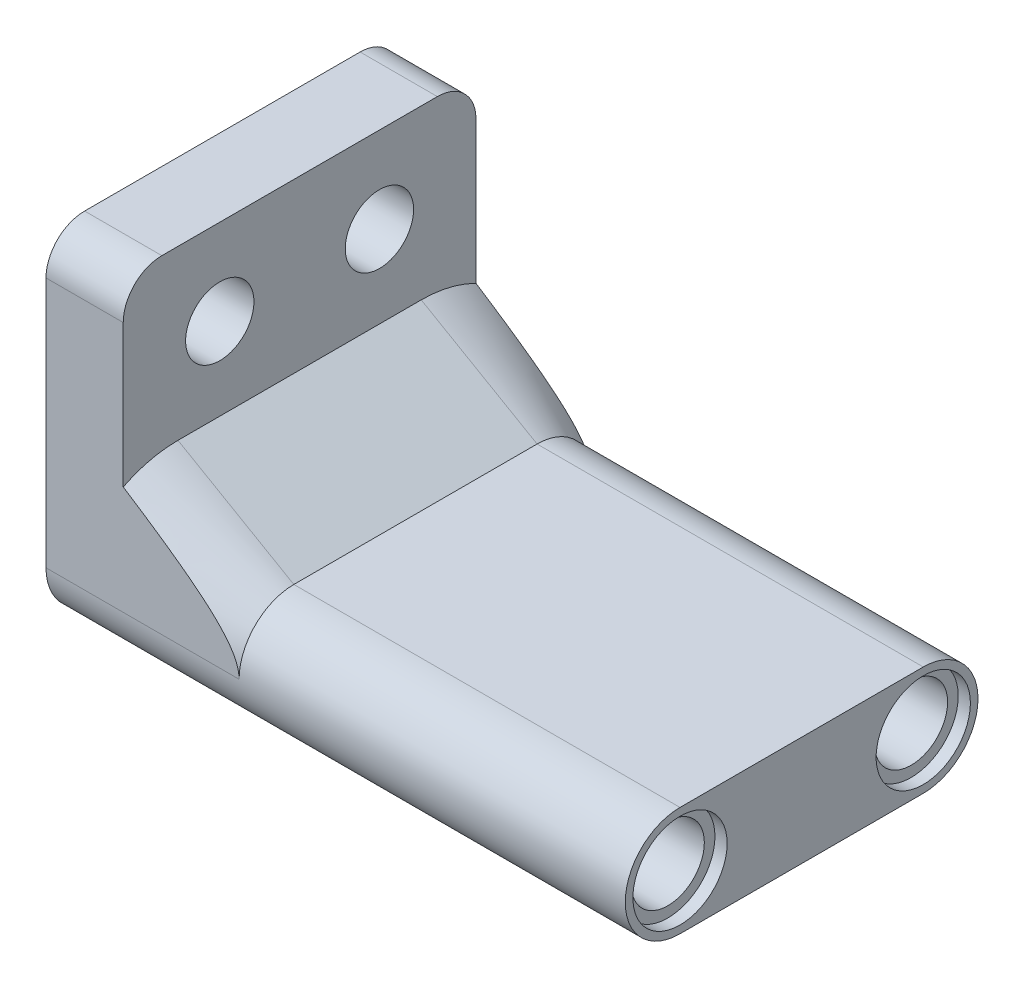
ISO-10303-21;
HEADER;
FILE_DESCRIPTION(('STEP AP214'),'2;1');
FILE_NAME('part.step','',(''),(''),'','','');
FILE_SCHEMA(('AUTOMOTIVE_DESIGN { 1 0 10303 214 1 1 1 1 }'));
ENDSEC;
DATA;
#1=APPLICATION_CONTEXT('core data for automotive mechanical design processes');
#2=APPLICATION_PROTOCOL_DEFINITION('international standard','automotive_design',2000,#1);
#3=PRODUCT_CONTEXT('',#1,'mechanical');
#4=PRODUCT('Part','Part','',(#3));
#5=PRODUCT_RELATED_PRODUCT_CATEGORY('part','',(#4));
#6=PRODUCT_DEFINITION_FORMATION('','',#4);
#7=PRODUCT_DEFINITION_CONTEXT('part definition',#1,'design');
#8=PRODUCT_DEFINITION('design','',#6,#7);
#9=PRODUCT_DEFINITION_SHAPE('','',#8);
#10=(LENGTH_UNIT() NAMED_UNIT(*) SI_UNIT(.MILLI.,.METRE.));
#11=(NAMED_UNIT(*) PLANE_ANGLE_UNIT() SI_UNIT($,.RADIAN.));
#12=(NAMED_UNIT(*) SI_UNIT($,.STERADIAN.) SOLID_ANGLE_UNIT());
#13=UNCERTAINTY_MEASURE_WITH_UNIT(LENGTH_MEASURE(1.E-05),#10,'distance_accuracy_value','');
#14=(GEOMETRIC_REPRESENTATION_CONTEXT(3) GLOBAL_UNCERTAINTY_ASSIGNED_CONTEXT((#13)) GLOBAL_UNIT_ASSIGNED_CONTEXT((#10,
#11,#12)) REPRESENTATION_CONTEXT('',''));
#15=CARTESIAN_POINT('',(0.,0.,0.));
#16=DIRECTION('',(0.,0.,1.));
#17=DIRECTION('',(1.,0.,0.));
#18=AXIS2_PLACEMENT_3D('',#15,#16,#17);
#19=CARTESIAN_POINT('',(38.1,3.59999999999999,16.));
#20=DIRECTION('',(-1.,0.,0.));
#21=DIRECTION('',(0.,0.,1.));
#22=AXIS2_PLACEMENT_3D('',#19,#20,#21);
#23=CYLINDRICAL_SURFACE('',#22,3.6);
#24=DIRECTION('',(-1.,0.,0.));
#25=VECTOR('',#24,1.);
#26=CARTESIAN_POINT('',(38.1,7.2,16.));
#27=LINE('',#26,#25);
#28=CARTESIAN_POINT('',(38.1,7.2,16.));
#29=VERTEX_POINT('',#28);
#30=CARTESIAN_POINT('',(12.7,7.2,16.));
#31=VERTEX_POINT('',#30);
#32=EDGE_CURVE('E369',#29,#31,#27,.T.);
#33=ORIENTED_EDGE('',*,*,#32,.T.);
#34=CARTESIAN_POINT('',(12.7,3.59999999999999,16.));
#35=DIRECTION('',(-1.,0.,0.));
#36=DIRECTION('',(0.,0.,1.));
#37=AXIS2_PLACEMENT_3D('',#34,#35,#36);
#38=CIRCLE('',#37,3.6);
#39=CARTESIAN_POINT('',(12.7,3.60000008799999,19.6));
#40=VERTEX_POINT('',#39);
#41=EDGE_CURVE('E209',#31,#40,#38,.F.);
#42=ORIENTED_EDGE('',*,*,#41,.T.);
#43=DIRECTION('',(1.,0.,0.));
#44=VECTOR('',#43,1.);
#45=CARTESIAN_POINT('',(0.,3.60000008799999,19.6));
#46=LINE('',#45,#44);
#47=CARTESIAN_POINT('',(0.,3.60000008799999,19.6));
#48=VERTEX_POINT('',#47);
#49=EDGE_CURVE('E297',#48,#40,#46,.T.);
#50=ORIENTED_EDGE('',*,*,#49,.F.);
#51=CARTESIAN_POINT('',(0.,3.59999999999999,16.));
#52=DIRECTION('',(1.,0.,0.));
#53=DIRECTION('',(0.,0.,-1.));
#54=AXIS2_PLACEMENT_3D('',#51,#52,#53);
#55=CIRCLE('',#54,3.6);
#56=CARTESIAN_POINT('',(0.,0.,16.));
#57=VERTEX_POINT('',#56);
#58=EDGE_CURVE('E164',#48,#57,#55,.T.);
#59=ORIENTED_EDGE('',*,*,#58,.T.);
#60=DIRECTION('',(-1.,0.,0.));
#61=VECTOR('',#60,1.);
#62=CARTESIAN_POINT('',(38.1,0.,16.));
#63=LINE('',#62,#61);
#64=CARTESIAN_POINT('',(38.1,0.,16.));
#65=VERTEX_POINT('',#64);
#66=EDGE_CURVE('E143',#65,#57,#63,.T.);
#67=ORIENTED_EDGE('',*,*,#66,.F.);
#68=CARTESIAN_POINT('',(38.1,3.59999999999999,16.));
#69=DIRECTION('',(1.,0.,0.));
#70=DIRECTION('',(0.,0.,-1.));
#71=AXIS2_PLACEMENT_3D('',#68,#69,#70);
#72=CIRCLE('',#71,3.6);
#73=EDGE_CURVE('E150',#29,#65,#72,.T.);
#74=ORIENTED_EDGE('',*,*,#73,.F.);
#75=EDGE_LOOP('',(#33,#42,#50,#59,#67,#74));
#76=FACE_BOUND('',#75,.T.);
#77=ADVANCED_FACE('F45',(#76),#23,.T.);
#78=CARTESIAN_POINT('',(38.1,3.6,0.));
#79=DIRECTION('',(-1.,0.,0.));
#80=DIRECTION('',(0.,0.,1.));
#81=AXIS2_PLACEMENT_3D('',#78,#79,#80);
#82=CYLINDRICAL_SURFACE('',#81,3.6);
#83=DIRECTION('',(-1.,0.,0.));
#84=VECTOR('',#83,1.);
#85=CARTESIAN_POINT('',(0.,3.600000088,-3.6));
#86=LINE('',#85,#84);
#87=CARTESIAN_POINT('',(12.7,3.600000088,-3.6));
#88=VERTEX_POINT('',#87);
#89=CARTESIAN_POINT('',(0.,3.600000088,-3.6));
#90=VERTEX_POINT('',#89);
#91=EDGE_CURVE('E65',#88,#90,#86,.T.);
#92=ORIENTED_EDGE('',*,*,#91,.F.);
#93=CARTESIAN_POINT('',(12.7,3.6,0.));
#94=DIRECTION('',(-1.,0.,0.));
#95=DIRECTION('',(0.,0.,1.));
#96=AXIS2_PLACEMENT_3D('',#93,#94,#95);
#97=CIRCLE('',#96,3.6);
#98=CARTESIAN_POINT('',(12.7,7.2,0.));
#99=VERTEX_POINT('',#98);
#100=EDGE_CURVE('E69',#88,#99,#97,.F.);
#101=ORIENTED_EDGE('',*,*,#100,.T.);
#102=DIRECTION('',(-1.,0.,0.));
#103=VECTOR('',#102,1.);
#104=CARTESIAN_POINT('',(38.1,7.2,0.));
#105=LINE('',#104,#103);
#106=CARTESIAN_POINT('',(38.1,7.2,0.));
#107=VERTEX_POINT('',#106);
#108=EDGE_CURVE('E174',#107,#99,#105,.T.);
#109=ORIENTED_EDGE('',*,*,#108,.F.);
#110=CARTESIAN_POINT('',(38.1,3.6,0.));
#111=DIRECTION('',(1.,0.,0.));
#112=DIRECTION('',(0.,0.,-1.));
#113=AXIS2_PLACEMENT_3D('',#110,#111,#112);
#114=CIRCLE('',#113,3.6);
#115=CARTESIAN_POINT('',(38.1,0.,0.));
#116=VERTEX_POINT('',#115);
#117=EDGE_CURVE('E149',#116,#107,#114,.T.);
#118=ORIENTED_EDGE('',*,*,#117,.F.);
#119=DIRECTION('',(-1.,0.,0.));
#120=VECTOR('',#119,1.);
#121=CARTESIAN_POINT('',(38.1,0.,0.));
#122=LINE('',#121,#120);
#123=CARTESIAN_POINT('',(0.,0.,0.));
#124=VERTEX_POINT('',#123);
#125=EDGE_CURVE('E145',#116,#124,#122,.T.);
#126=ORIENTED_EDGE('',*,*,#125,.T.);
#127=CARTESIAN_POINT('',(0.,3.6,0.));
#128=DIRECTION('',(1.,0.,0.));
#129=DIRECTION('',(0.,0.,-1.));
#130=AXIS2_PLACEMENT_3D('',#127,#128,#129);
#131=CIRCLE('',#130,3.6);
#132=EDGE_CURVE('E160',#124,#90,#131,.T.);
#133=ORIENTED_EDGE('',*,*,#132,.T.);
#134=EDGE_LOOP('',(#92,#101,#109,#118,#126,#133));
#135=FACE_BOUND('',#134,.T.);
#136=ADVANCED_FACE('F257',(#135),#82,.T.);
#137=CARTESIAN_POINT('',(38.1,7.2,0.));
#138=DIRECTION('',(0.,-1.,0.));
#139=DIRECTION('',(0.,0.,-1.));
#140=AXIS2_PLACEMENT_3D('',#137,#138,#139);
#141=PLANE('',#140);
#142=ORIENTED_EDGE('',*,*,#108,.T.);
#143=DIRECTION('',(0.,0.,1.));
#144=VECTOR('',#143,1.);
#145=CARTESIAN_POINT('',(12.7,7.2,16.));
#146=LINE('',#145,#144);
#147=EDGE_CURVE('E215',#99,#31,#146,.T.);
#148=ORIENTED_EDGE('',*,*,#147,.T.);
#149=ORIENTED_EDGE('',*,*,#32,.F.);
#150=DIRECTION('',(0.,0.,1.));
#151=VECTOR('',#150,1.);
#152=CARTESIAN_POINT('',(38.1,7.2,0.));
#153=LINE('',#152,#151);
#154=EDGE_CURVE('E155',#107,#29,#153,.T.);
#155=ORIENTED_EDGE('',*,*,#154,.F.);
#156=EDGE_LOOP('',(#142,#148,#149,#155));
#157=FACE_BOUND('',#156,.T.);
#158=ADVANCED_FACE('F262',(#157),#141,.F.);
#159=CARTESIAN_POINT('',(38.1,0.,0.));
#160=DIRECTION('',(0.,1.,0.));
#161=DIRECTION('',(0.,0.,1.));
#162=AXIS2_PLACEMENT_3D('',#159,#160,#161);
#163=PLANE('',#162);
#164=DIRECTION('',(0.,0.,-1.));
#165=VECTOR('',#164,1.);
#166=CARTESIAN_POINT('',(0.,0.,0.));
#167=LINE('',#166,#165);
#168=EDGE_CURVE('E372',#57,#124,#167,.T.);
#169=ORIENTED_EDGE('',*,*,#168,.T.);
#170=ORIENTED_EDGE('',*,*,#125,.F.);
#171=DIRECTION('',(0.,0.,-1.));
#172=VECTOR('',#171,1.);
#173=CARTESIAN_POINT('',(38.1,0.,0.));
#174=LINE('',#173,#172);
#175=EDGE_CURVE('E139',#65,#116,#174,.T.);
#176=ORIENTED_EDGE('',*,*,#175,.F.);
#177=ORIENTED_EDGE('',*,*,#66,.T.);
#178=EDGE_LOOP('',(#169,#170,#176,#177));
#179=FACE_BOUND('',#178,.T.);
#180=ADVANCED_FACE('F141',(#179),#163,.F.);
#181=CARTESIAN_POINT('',(38.1,3.59999999999999,16.));
#182=DIRECTION('',(1.,0.,0.));
#183=DIRECTION('',(0.,0.,-1.));
#184=AXIS2_PLACEMENT_3D('',#181,#182,#183);
#185=PLANE('',#184);
#186=CARTESIAN_POINT('',(38.1,3.6,0.));
#187=DIRECTION('',(1.,0.,0.));
#188=DIRECTION('',(0.,0.,-1.));
#189=AXIS2_PLACEMENT_3D('',#186,#187,#188);
#190=CIRCLE('',#189,3.1);
#191=CARTESIAN_POINT('',(38.1,3.6,-3.1));
#192=VERTEX_POINT('',#191);
#193=EDGE_CURVE('E339',#192,#192,#190,.T.);
#194=ORIENTED_EDGE('',*,*,#193,.F.);
#195=EDGE_LOOP('',(#194));
#196=FACE_BOUND('',#195,.T.);
#197=CARTESIAN_POINT('',(38.1,3.6,16.000000088));
#198=DIRECTION('',(1.,0.,0.));
#199=DIRECTION('',(0.,0.,-1.));
#200=AXIS2_PLACEMENT_3D('',#197,#198,#199);
#201=CIRCLE('',#200,3.1);
#202=CARTESIAN_POINT('',(38.1,3.6,12.900000088));
#203=VERTEX_POINT('',#202);
#204=EDGE_CURVE('E351',#203,#203,#201,.T.);
#205=ORIENTED_EDGE('',*,*,#204,.F.);
#206=EDGE_LOOP('',(#205));
#207=FACE_BOUND('',#206,.T.);
#208=ORIENTED_EDGE('',*,*,#73,.T.);
#209=ORIENTED_EDGE('',*,*,#175,.T.);
#210=ORIENTED_EDGE('',*,*,#117,.T.);
#211=ORIENTED_EDGE('',*,*,#154,.T.);
#212=EDGE_LOOP('',(#208,#209,#210,#211));
#213=FACE_BOUND('',#212,.T.);
#214=ADVANCED_FACE('F153',(#196,#207,#213),#185,.T.);
#215=CARTESIAN_POINT('',(0.,3.59999999999999,16.));
#216=DIRECTION('',(1.,0.,0.));
#217=DIRECTION('',(0.,0.,-1.));
#218=AXIS2_PLACEMENT_3D('',#215,#216,#217);
#219=PLANE('',#218);
#220=CARTESIAN_POINT('',(0.,17.0069029904066,13.25));
#221=DIRECTION('',(1.,0.,0.));
#222=DIRECTION('',(0.,0.,-1.));
#223=AXIS2_PLACEMENT_3D('',#220,#221,#222);
#224=CIRCLE('',#223,2.2479);
#225=CARTESIAN_POINT('',(0.,17.0069029904066,11.0021));
#226=VERTEX_POINT('',#225);
#227=EDGE_CURVE('E398',#226,#226,#224,.T.);
#228=ORIENTED_EDGE('',*,*,#227,.T.);
#229=EDGE_LOOP('',(#228));
#230=FACE_BOUND('',#229,.T.);
#231=CARTESIAN_POINT('',(0.,17.0069029904066,2.75000000000001));
#232=DIRECTION('',(1.,0.,0.));
#233=DIRECTION('',(0.,0.,-1.));
#234=AXIS2_PLACEMENT_3D('',#231,#232,#233);
#235=CIRCLE('',#234,2.2479);
#236=CARTESIAN_POINT('',(0.,17.0069029904066,0.50210000000001));
#237=VERTEX_POINT('',#236);
#238=EDGE_CURVE('E300',#237,#237,#235,.T.);
#239=ORIENTED_EDGE('',*,*,#238,.T.);
#240=EDGE_LOOP('',(#239));
#241=FACE_BOUND('',#240,.T.);
#242=DIRECTION('',(0.,-1.,0.));
#243=VECTOR('',#242,1.);
#244=CARTESIAN_POINT('',(0.,22.650000088,19.6));
#245=LINE('',#244,#243);
#246=CARTESIAN_POINT('',(0.,20.110000088,19.6));
#247=VERTEX_POINT('',#246);
#248=EDGE_CURVE('E286',#247,#48,#245,.T.);
#249=ORIENTED_EDGE('',*,*,#248,.F.);
#250=CARTESIAN_POINT('',(0.,20.110000088,17.06));
#251=DIRECTION('',(1.,0.,0.));
#252=DIRECTION('',(0.,0.,-1.));
#253=AXIS2_PLACEMENT_3D('',#250,#251,#252);
#254=CIRCLE('',#253,2.54);
#255=CARTESIAN_POINT('',(0.,22.650000088,17.06));
#256=VERTEX_POINT('',#255);
#257=EDGE_CURVE('E193',#247,#256,#254,.F.);
#258=ORIENTED_EDGE('',*,*,#257,.T.);
#259=DIRECTION('',(0.,0.,1.));
#260=VECTOR('',#259,1.);
#261=CARTESIAN_POINT('',(0.,22.650000088,-3.59999999999999));
#262=LINE('',#261,#260);
#263=CARTESIAN_POINT('',(0.,22.650000088,-1.05999999999999));
#264=VERTEX_POINT('',#263);
#265=EDGE_CURVE('E285',#264,#256,#262,.T.);
#266=ORIENTED_EDGE('',*,*,#265,.F.);
#267=CARTESIAN_POINT('',(0.,20.110000088,-1.05999999999999));
#268=DIRECTION('',(1.,0.,0.));
#269=DIRECTION('',(0.,0.,-1.));
#270=AXIS2_PLACEMENT_3D('',#267,#268,#269);
#271=CIRCLE('',#270,2.54);
#272=CARTESIAN_POINT('',(0.,20.110000088,-3.59999999999999));
#273=VERTEX_POINT('',#272);
#274=EDGE_CURVE('E190',#264,#273,#271,.F.);
#275=ORIENTED_EDGE('',*,*,#274,.T.);
#276=DIRECTION('',(0.,-1.,0.));
#277=VECTOR('',#276,1.);
#278=CARTESIAN_POINT('',(0.,22.650000088,-3.59999999999999));
#279=LINE('',#278,#277);
#280=EDGE_CURVE('E295',#273,#90,#279,.T.);
#281=ORIENTED_EDGE('',*,*,#280,.T.);
#282=ORIENTED_EDGE('',*,*,#132,.F.);
#283=ORIENTED_EDGE('',*,*,#168,.F.);
#284=ORIENTED_EDGE('',*,*,#58,.F.);
#285=EDGE_LOOP('',(#249,#258,#266,#275,#281,#282,#283,#284));
#286=FACE_BOUND('',#285,.T.);
#287=ADVANCED_FACE('F284',(#230,#241,#286),#219,.F.);
#288=CARTESIAN_POINT('',(37.3,3.6,0.));
#289=DIRECTION('',(1.,0.,0.));
#290=DIRECTION('',(0.,0.,-1.));
#291=AXIS2_PLACEMENT_3D('',#288,#289,#290);
#292=CYLINDRICAL_SURFACE('',#291,3.1);
#293=CARTESIAN_POINT('',(37.3,3.6,0.));
#294=DIRECTION('',(1.,0.,0.));
#295=DIRECTION('',(0.,0.,-1.));
#296=AXIS2_PLACEMENT_3D('',#293,#294,#295);
#297=CIRCLE('',#296,3.1);
#298=CARTESIAN_POINT('',(37.3,3.6,-3.1));
#299=VERTEX_POINT('',#298);
#300=EDGE_CURVE('E338',#299,#299,#297,.T.);
#301=ORIENTED_EDGE('',*,*,#300,.F.);
#302=EDGE_LOOP('',(#301));
#303=FACE_BOUND('',#302,.T.);
#304=ORIENTED_EDGE('',*,*,#193,.T.);
#305=EDGE_LOOP('',(#304));
#306=FACE_BOUND('',#305,.T.);
#307=ADVANCED_FACE('F442',(#303,#306),#292,.F.);
#308=CARTESIAN_POINT('',(37.3,0.,0.));
#309=DIRECTION('',(1.,0.,0.));
#310=DIRECTION('',(0.,0.,-1.));
#311=AXIS2_PLACEMENT_3D('',#308,#309,#310);
#312=PLANE('',#311);
#313=CARTESIAN_POINT('',(37.3,3.6,0.));
#314=DIRECTION('',(1.,0.,0.));
#315=DIRECTION('',(0.,0.,-1.));
#316=AXIS2_PLACEMENT_3D('',#313,#314,#315);
#317=CIRCLE('',#316,2.4);
#318=CARTESIAN_POINT('',(37.3,3.6,-2.4));
#319=VERTEX_POINT('',#318);
#320=EDGE_CURVE('E334',#319,#319,#317,.T.);
#321=ORIENTED_EDGE('',*,*,#320,.F.);
#322=EDGE_LOOP('',(#321));
#323=FACE_BOUND('',#322,.T.);
#324=ORIENTED_EDGE('',*,*,#300,.T.);
#325=EDGE_LOOP('',(#324));
#326=FACE_BOUND('',#325,.T.);
#327=ADVANCED_FACE('F448',(#323,#326),#312,.T.);
#328=CARTESIAN_POINT('',(37.3,3.6,16.000000088));
#329=DIRECTION('',(1.,0.,0.));
#330=DIRECTION('',(0.,0.,-1.));
#331=AXIS2_PLACEMENT_3D('',#328,#329,#330);
#332=CYLINDRICAL_SURFACE('',#331,3.1);
#333=CARTESIAN_POINT('',(37.3,3.6,16.000000088));
#334=DIRECTION('',(1.,0.,0.));
#335=DIRECTION('',(0.,0.,-1.));
#336=AXIS2_PLACEMENT_3D('',#333,#334,#335);
#337=CIRCLE('',#336,3.1);
#338=CARTESIAN_POINT('',(37.3,3.6,12.900000088));
#339=VERTEX_POINT('',#338);
#340=EDGE_CURVE('E346',#339,#339,#337,.T.);
#341=ORIENTED_EDGE('',*,*,#340,.F.);
#342=EDGE_LOOP('',(#341));
#343=FACE_BOUND('',#342,.T.);
#344=ORIENTED_EDGE('',*,*,#204,.T.);
#345=EDGE_LOOP('',(#344));
#346=FACE_BOUND('',#345,.T.);
#347=ADVANCED_FACE('F484',(#343,#346),#332,.F.);
#348=CARTESIAN_POINT('',(37.3,0.,0.));
#349=DIRECTION('',(1.,0.,0.));
#350=DIRECTION('',(0.,0.,-1.));
#351=AXIS2_PLACEMENT_3D('',#348,#349,#350);
#352=PLANE('',#351);
#353=CARTESIAN_POINT('',(37.3,3.6,16.000000088));
#354=DIRECTION('',(1.,0.,0.));
#355=DIRECTION('',(0.,0.,-1.));
#356=AXIS2_PLACEMENT_3D('',#353,#354,#355);
#357=CIRCLE('',#356,2.4);
#358=CARTESIAN_POINT('',(37.3,3.6,13.600000088));
#359=VERTEX_POINT('',#358);
#360=EDGE_CURVE('E347',#359,#359,#357,.T.);
#361=ORIENTED_EDGE('',*,*,#360,.F.);
#362=EDGE_LOOP('',(#361));
#363=FACE_BOUND('',#362,.T.);
#364=ORIENTED_EDGE('',*,*,#340,.T.);
#365=EDGE_LOOP('',(#364));
#366=FACE_BOUND('',#365,.T.);
#367=ADVANCED_FACE('F495',(#363,#366),#352,.T.);
#368=CARTESIAN_POINT('',(30.1,3.6,0.));
#369=DIRECTION('',(1.,0.,0.));
#370=DIRECTION('',(0.,0.,-1.));
#371=AXIS2_PLACEMENT_3D('',#368,#369,#370);
#372=CYLINDRICAL_SURFACE('',#371,2.4);
#373=CARTESIAN_POINT('',(30.1,3.6,0.));
#374=DIRECTION('',(1.,0.,0.));
#375=DIRECTION('',(0.,0.,-1.));
#376=AXIS2_PLACEMENT_3D('',#373,#374,#375);
#377=CIRCLE('',#376,2.4);
#378=CARTESIAN_POINT('',(30.1,3.6,-2.4));
#379=VERTEX_POINT('',#378);
#380=EDGE_CURVE('E358',#379,#379,#377,.T.);
#381=ORIENTED_EDGE('',*,*,#380,.F.);
#382=EDGE_LOOP('',(#381));
#383=FACE_BOUND('',#382,.T.);
#384=ORIENTED_EDGE('',*,*,#320,.T.);
#385=EDGE_LOOP('',(#384));
#386=FACE_BOUND('',#385,.T.);
#387=ADVANCED_FACE('F506',(#383,#386),#372,.F.);
#388=CARTESIAN_POINT('',(30.1,3.6,16.000000088));
#389=DIRECTION('',(1.,0.,0.));
#390=DIRECTION('',(0.,0.,-1.));
#391=AXIS2_PLACEMENT_3D('',#388,#389,#390);
#392=CYLINDRICAL_SURFACE('',#391,2.4);
#393=CARTESIAN_POINT('',(30.1,3.6,16.000000088));
#394=DIRECTION('',(1.,0.,0.));
#395=DIRECTION('',(0.,0.,-1.));
#396=AXIS2_PLACEMENT_3D('',#393,#394,#395);
#397=CIRCLE('',#396,2.4);
#398=CARTESIAN_POINT('',(30.1,3.6,13.600000088));
#399=VERTEX_POINT('',#398);
#400=EDGE_CURVE('E322',#399,#399,#397,.T.);
#401=ORIENTED_EDGE('',*,*,#400,.F.);
#402=EDGE_LOOP('',(#401));
#403=FACE_BOUND('',#402,.T.);
#404=ORIENTED_EDGE('',*,*,#360,.T.);
#405=EDGE_LOOP('',(#404));
#406=FACE_BOUND('',#405,.T.);
#407=ADVANCED_FACE('F518',(#403,#406),#392,.F.);
#408=CARTESIAN_POINT('',(28.6,3.6,16.000000088));
#409=DIRECTION('',(1.,0.,0.));
#410=DIRECTION('',(0.,0.,-1.));
#411=AXIS2_PLACEMENT_3D('',#408,#409,#410);
#412=CYLINDRICAL_SURFACE('',#411,3.1);
#413=CARTESIAN_POINT('',(28.6,3.6,16.000000088));
#414=DIRECTION('',(1.,0.,0.));
#415=DIRECTION('',(0.,0.,-1.));
#416=AXIS2_PLACEMENT_3D('',#413,#414,#415);
#417=CIRCLE('',#416,3.1);
#418=CARTESIAN_POINT('',(28.6,3.6,12.900000088));
#419=VERTEX_POINT('',#418);
#420=EDGE_CURVE('E318',#419,#419,#417,.T.);
#421=ORIENTED_EDGE('',*,*,#420,.F.);
#422=EDGE_LOOP('',(#421));
#423=FACE_BOUND('',#422,.T.);
#424=CARTESIAN_POINT('',(30.1,3.6,16.000000088));
#425=DIRECTION('',(1.,0.,0.));
#426=DIRECTION('',(0.,0.,-1.));
#427=AXIS2_PLACEMENT_3D('',#424,#425,#426);
#428=CIRCLE('',#427,3.1);
#429=CARTESIAN_POINT('',(30.1,3.6,12.900000088));
#430=VERTEX_POINT('',#429);
#431=EDGE_CURVE('E323',#430,#430,#428,.T.);
#432=ORIENTED_EDGE('',*,*,#431,.T.);
#433=EDGE_LOOP('',(#432));
#434=FACE_BOUND('',#433,.T.);
#435=ADVANCED_FACE('F529',(#423,#434),#412,.F.);
#436=CARTESIAN_POINT('',(28.6,3.6,16.000000088));
#437=DIRECTION('',(1.,0.,0.));
#438=DIRECTION('',(0.,0.,-1.));
#439=AXIS2_PLACEMENT_3D('',#436,#437,#438);
#440=PLANE('',#439);
#441=ORIENTED_EDGE('',*,*,#420,.T.);
#442=EDGE_LOOP('',(#441));
#443=FACE_BOUND('',#442,.T.);
#444=ADVANCED_FACE('F536',(#443),#440,.T.);
#445=CARTESIAN_POINT('',(30.1,3.6,16.000000088));
#446=DIRECTION('',(1.,0.,0.));
#447=DIRECTION('',(0.,0.,-1.));
#448=AXIS2_PLACEMENT_3D('',#445,#446,#447);
#449=PLANE('',#448);
#450=ORIENTED_EDGE('',*,*,#400,.T.);
#451=EDGE_LOOP('',(#450));
#452=FACE_BOUND('',#451,.T.);
#453=ORIENTED_EDGE('',*,*,#431,.F.);
#454=EDGE_LOOP('',(#453));
#455=FACE_BOUND('',#454,.T.);
#456=ADVANCED_FACE('F547',(#452,#455),#449,.F.);
#457=CARTESIAN_POINT('',(28.6,3.6,0.));
#458=DIRECTION('',(1.,0.,0.));
#459=DIRECTION('',(0.,0.,-1.));
#460=AXIS2_PLACEMENT_3D('',#457,#458,#459);
#461=CYLINDRICAL_SURFACE('',#460,3.1);
#462=CARTESIAN_POINT('',(28.6,3.6,0.));
#463=DIRECTION('',(1.,0.,0.));
#464=DIRECTION('',(0.,0.,-1.));
#465=AXIS2_PLACEMENT_3D('',#462,#463,#464);
#466=CIRCLE('',#465,3.1);
#467=CARTESIAN_POINT('',(28.6,3.6,-3.1));
#468=VERTEX_POINT('',#467);
#469=EDGE_CURVE('E317',#468,#468,#466,.T.);
#470=ORIENTED_EDGE('',*,*,#469,.F.);
#471=EDGE_LOOP('',(#470));
#472=FACE_BOUND('',#471,.T.);
#473=CARTESIAN_POINT('',(30.1,3.6,0.));
#474=DIRECTION('',(1.,0.,0.));
#475=DIRECTION('',(0.,0.,-1.));
#476=AXIS2_PLACEMENT_3D('',#473,#474,#475);
#477=CIRCLE('',#476,3.1);
#478=CARTESIAN_POINT('',(30.1,3.6,-3.1));
#479=VERTEX_POINT('',#478);
#480=EDGE_CURVE('E327',#479,#479,#477,.T.);
#481=ORIENTED_EDGE('',*,*,#480,.T.);
#482=EDGE_LOOP('',(#481));
#483=FACE_BOUND('',#482,.T.);
#484=ADVANCED_FACE('F557',(#472,#483),#461,.F.);
#485=CARTESIAN_POINT('',(28.6,3.6,0.));
#486=DIRECTION('',(1.,0.,0.));
#487=DIRECTION('',(0.,0.,-1.));
#488=AXIS2_PLACEMENT_3D('',#485,#486,#487);
#489=PLANE('',#488);
#490=ORIENTED_EDGE('',*,*,#469,.T.);
#491=EDGE_LOOP('',(#490));
#492=FACE_BOUND('',#491,.T.);
#493=ADVANCED_FACE('F568',(#492),#489,.T.);
#494=CARTESIAN_POINT('',(30.1,3.6,0.));
#495=DIRECTION('',(1.,0.,0.));
#496=DIRECTION('',(0.,0.,-1.));
#497=AXIS2_PLACEMENT_3D('',#494,#495,#496);
#498=PLANE('',#497);
#499=ORIENTED_EDGE('',*,*,#380,.T.);
#500=EDGE_LOOP('',(#499));
#501=FACE_BOUND('',#500,.T.);
#502=ORIENTED_EDGE('',*,*,#480,.F.);
#503=EDGE_LOOP('',(#502));
#504=FACE_BOUND('',#503,.T.);
#505=ADVANCED_FACE('F415',(#501,#504),#498,.F.);
#506=CARTESIAN_POINT('',(5.08,22.650000088,-3.59999999999999));
#507=DIRECTION('',(-1.,0.,0.));
#508=DIRECTION('',(0.,0.,1.));
#509=AXIS2_PLACEMENT_3D('',#506,#507,#508);
#510=PLANE('',#509);
#511=CARTESIAN_POINT('',(5.08,17.0069029904066,13.25));
#512=DIRECTION('',(1.,0.,0.));
#513=DIRECTION('',(0.,0.,-1.));
#514=AXIS2_PLACEMENT_3D('',#511,#512,#513);
#515=CIRCLE('',#514,2.24789999999999);
#516=CARTESIAN_POINT('',(5.08,17.0069029904066,11.0021));
#517=VERTEX_POINT('',#516);
#518=EDGE_CURVE('E403',#517,#517,#515,.T.);
#519=ORIENTED_EDGE('',*,*,#518,.F.);
#520=EDGE_LOOP('',(#519));
#521=FACE_BOUND('',#520,.T.);
#522=CARTESIAN_POINT('',(5.08,17.0069029904066,2.75000000000001));
#523=DIRECTION('',(1.,0.,0.));
#524=DIRECTION('',(0.,0.,-1.));
#525=AXIS2_PLACEMENT_3D('',#522,#523,#524);
#526=CIRCLE('',#525,2.24789999999999);
#527=CARTESIAN_POINT('',(5.08,17.0069029904066,0.50210000000002));
#528=VERTEX_POINT('',#527);
#529=EDGE_CURVE('E393',#528,#528,#526,.T.);
#530=ORIENTED_EDGE('',*,*,#529,.F.);
#531=EDGE_LOOP('',(#530));
#532=FACE_BOUND('',#531,.T.);
#533=DIRECTION('',(0.,-1.,0.));
#534=VECTOR('',#533,1.);
#535=CARTESIAN_POINT('',(5.08,22.650000088,19.6));
#536=LINE('',#535,#534);
#537=CARTESIAN_POINT('',(5.08,20.110000088,19.6));
#538=VERTEX_POINT('',#537);
#539=CARTESIAN_POINT('',(5.08,10.7435666980032,19.6));
#540=VERTEX_POINT('',#539);
#541=EDGE_CURVE('E311',#538,#540,#536,.T.);
#542=ORIENTED_EDGE('',*,*,#541,.T.);
#543=CARTESIAN_POINT('',(5.08,3.59999999999999,16.));
#544=DIRECTION('',(-1.,0.,0.));
#545=DIRECTION('',(0.,0.,1.));
#546=AXIS2_PLACEMENT_3D('',#543,#544,#545);
#547=CIRCLE('',#546,7.99940905122498);
#548=CARTESIAN_POINT('',(5.08,11.599409051225,16.));
#549=VERTEX_POINT('',#548);
#550=EDGE_CURVE('E205',#540,#549,#547,.T.);
#551=ORIENTED_EDGE('',*,*,#550,.T.);
#552=DIRECTION('',(0.,0.,-1.));
#553=VECTOR('',#552,1.);
#554=CARTESIAN_POINT('',(5.08,11.599409051225,0.));
#555=LINE('',#554,#553);
#556=CARTESIAN_POINT('',(5.08,11.599409051225,0.));
#557=VERTEX_POINT('',#556);
#558=EDGE_CURVE('E199',#549,#557,#555,.T.);
#559=ORIENTED_EDGE('',*,*,#558,.T.);
#560=CARTESIAN_POINT('',(5.08,3.6,0.));
#561=DIRECTION('',(-1.,0.,0.));
#562=DIRECTION('',(0.,0.,1.));
#563=AXIS2_PLACEMENT_3D('',#560,#561,#562);
#564=CIRCLE('',#563,7.99940905122499);
#565=CARTESIAN_POINT('',(5.08,10.7435666980032,-3.6));
#566=VERTEX_POINT('',#565);
#567=EDGE_CURVE('E202',#557,#566,#564,.T.);
#568=ORIENTED_EDGE('',*,*,#567,.T.);
#569=DIRECTION('',(0.,-1.,0.));
#570=VECTOR('',#569,1.);
#571=CARTESIAN_POINT('',(5.08,22.650000088,-3.59999999999999));
#572=LINE('',#571,#570);
#573=CARTESIAN_POINT('',(5.08,20.110000088,-3.59999999999999));
#574=VERTEX_POINT('',#573);
#575=EDGE_CURVE('E307',#574,#566,#572,.T.);
#576=ORIENTED_EDGE('',*,*,#575,.F.);
#577=CARTESIAN_POINT('',(5.08,20.110000088,-1.05999999999999));
#578=DIRECTION('',(-1.,0.,0.));
#579=DIRECTION('',(0.,0.,1.));
#580=AXIS2_PLACEMENT_3D('',#577,#578,#579);
#581=CIRCLE('',#580,2.54);
#582=CARTESIAN_POINT('',(5.08,22.650000088,-1.05999999999999));
#583=VERTEX_POINT('',#582);
#584=EDGE_CURVE('E181',#574,#583,#581,.F.);
#585=ORIENTED_EDGE('',*,*,#584,.T.);
#586=DIRECTION('',(0.,0.,-1.));
#587=VECTOR('',#586,1.);
#588=CARTESIAN_POINT('',(5.08,22.650000088,-3.59999999999999));
#589=LINE('',#588,#587);
#590=CARTESIAN_POINT('',(5.08,22.650000088,17.06));
#591=VERTEX_POINT('',#590);
#592=EDGE_CURVE('E291',#591,#583,#589,.T.);
#593=ORIENTED_EDGE('',*,*,#592,.F.);
#594=CARTESIAN_POINT('',(5.08,20.110000088,17.06));
#595=DIRECTION('',(-1.,0.,0.));
#596=DIRECTION('',(0.,0.,1.));
#597=AXIS2_PLACEMENT_3D('',#594,#595,#596);
#598=CIRCLE('',#597,2.54);
#599=EDGE_CURVE('E184',#591,#538,#598,.F.);
#600=ORIENTED_EDGE('',*,*,#599,.T.);
#601=EDGE_LOOP('',(#542,#551,#559,#568,#576,#585,#593,#600));
#602=FACE_BOUND('',#601,.T.);
#603=ADVANCED_FACE('F412',(#521,#532,#602),#510,.F.);
#604=CARTESIAN_POINT('',(0.,22.650000088,19.6));
#605=DIRECTION('',(0.,0.,-1.));
#606=DIRECTION('',(0.,1.,0.));
#607=AXIS2_PLACEMENT_3D('',#604,#605,#606);
#608=PLANE('',#607);
#609=ORIENTED_EDGE('',*,*,#541,.F.);
#610=DIRECTION('',(1.,0.,0.));
#611=VECTOR('',#610,1.);
#612=CARTESIAN_POINT('',(0.,20.110000088,19.6));
#613=LINE('',#612,#611);
#614=EDGE_CURVE('E187',#538,#247,#613,.F.);
#615=ORIENTED_EDGE('',*,*,#614,.T.);
#616=ORIENTED_EDGE('',*,*,#248,.T.);
#617=ORIENTED_EDGE('',*,*,#49,.T.);
#618=CARTESIAN_POINT('',(12.7,3.60000008799999,19.6));
#619=CARTESIAN_POINT('',(12.700060902116,3.67154026931214,19.6));
#620=CARTESIAN_POINT('',(12.6963083757973,3.74304084940573,19.6));
#621=CARTESIAN_POINT('',(12.6816585676101,3.88514317868667,19.6));
#622=CARTESIAN_POINT('',(12.6707780824575,3.95574664415,19.6));
#623=CARTESIAN_POINT('',(12.6426567338283,4.09407012274762,19.6));
#624=CARTESIAN_POINT('',(12.6255580274144,4.16181948496407,19.6));
#625=CARTESIAN_POINT('',(12.5856784223071,4.29564936790406,19.6));
#626=CARTESIAN_POINT('',(12.5628939411353,4.36172880742853,19.6));
#627=CARTESIAN_POINT('',(12.5014919102299,4.52009850117679,19.6));
#628=CARTESIAN_POINT('',(12.4602860472355,4.61138429843869,19.6));
#629=CARTESIAN_POINT('',(12.3698939293627,4.78989404693301,19.6));
#630=CARTESIAN_POINT('',(12.3207034587277,4.87711582093763,19.6));
#631=CARTESIAN_POINT('',(12.2155499296112,5.04863936217237,19.6));
#632=CARTESIAN_POINT('',(12.1595194453784,5.13289940347602,19.6));
#633=CARTESIAN_POINT('',(12.0425426452833,5.29786219815385,19.6));
#634=CARTESIAN_POINT('',(11.9815977549703,5.37856597268458,19.6));
#635=CARTESIAN_POINT('',(11.814172757761,5.58937470964976,19.6));
#636=CARTESIAN_POINT('',(11.7042865418223,5.71676716475295,19.6));
#637=CARTESIAN_POINT('',(11.4771782216296,5.96488302386737,19.6));
#638=CARTESIAN_POINT('',(11.3599509464885,6.08560161165017,19.6));
#639=CARTESIAN_POINT('',(11.1199980548872,6.32199675400996,19.6));
#640=CARTESIAN_POINT('',(10.9972600093561,6.43766061674443,19.6));
#641=CARTESIAN_POINT('',(10.7479579371006,6.66469185401422,19.6));
#642=CARTESIAN_POINT('',(10.6213949540273,6.77606038200643,19.6));
#643=CARTESIAN_POINT('',(10.3647252552478,6.99588143189977,19.6));
#644=CARTESIAN_POINT('',(10.2346045282478,7.10431753200269,19.6));
#645=CARTESIAN_POINT('',(9.97204689101566,7.31835365818624,19.6));
#646=CARTESIAN_POINT('',(9.83960984892051,7.42395352193234,19.6));
#647=CARTESIAN_POINT('',(9.43994298753785,7.73695887957998,19.6));
#648=CARTESIAN_POINT('',(9.16998775298033,7.9408810756638,19.6));
#649=CARTESIAN_POINT('',(8.58463910802365,8.37211373739841,19.6));
#650=CARTESIAN_POINT('',(8.26847738270786,8.59837249731385,19.6));
#651=CARTESIAN_POINT('',(7.6317318989638,9.04489254475483,19.6));
#652=CARTESIAN_POINT('',(7.31114603662324,9.26515081948606,19.6));
#653=CARTESIAN_POINT('',(6.67319666115201,9.69695254702503,19.6));
#654=CARTESIAN_POINT('',(6.35589130267635,9.90858217120296,19.6));
#655=CARTESIAN_POINT('',(5.87841691516752,10.2234942346746,19.6));
#656=CARTESIAN_POINT('',(5.71905827869797,10.3280091878931,19.6));
#657=CARTESIAN_POINT('',(5.39986810035206,10.5363106900712,19.6));
#658=CARTESIAN_POINT('',(5.24003656379347,10.6400972471777,19.6));
#659=CARTESIAN_POINT('',(5.08,10.7435666980032,19.6));
#660=B_SPLINE_CURVE_WITH_KNOTS('',3,(#618,#619,#620,#621,#622,#623,#624,#625,#626,#627,#628,
#629,#630,#631,#632,#633,#634,#635,#636,#637,#638,#639,#640,#641,#642,#643,#644,#645,#646,#647,
#648,#649,#650,#651,#652,#653,#654,#655,#656,#657,#658,#659),.UNSPECIFIED.,.F.,.F.,(4,2,2,2,2,2,
2,2,2,2,2,2,2,2,2,2,2,2,2,2,4),(0.,0.214459022374007,0.428414490717735,0.637758028693927,
0.847233803834567,1.14717271313985,1.44727050403903,1.75061036960072,2.05386255802524,
2.55812154917719,3.0627398144036,3.56855979028504,4.07424297531707,4.58233553497034,
5.09045711405012,6.10525203075467,7.27150301338888,8.43832915432211,9.58251728128233,
10.1542385617377,10.7259534374519),.UNSPECIFIED.);
#661=EDGE_CURVE('E57',#40,#540,#660,.T.);
#662=ORIENTED_EDGE('',*,*,#661,.T.);
#663=EDGE_LOOP('',(#609,#615,#616,#617,#662));
#664=FACE_BOUND('',#663,.T.);
#665=ADVANCED_FACE('F230',(#664),#608,.F.);
#666=CARTESIAN_POINT('',(0.,22.650000088,-3.59999999999999));
#667=DIRECTION('',(0.,0.,1.));
#668=DIRECTION('',(0.,-1.,0.));
#669=AXIS2_PLACEMENT_3D('',#666,#667,#668);
#670=PLANE('',#669);
#671=ORIENTED_EDGE('',*,*,#280,.F.);
#672=DIRECTION('',(-1.,0.,0.));
#673=VECTOR('',#672,1.);
#674=CARTESIAN_POINT('',(5.08,20.110000088,-3.59999999999999));
#675=LINE('',#674,#673);
#676=EDGE_CURVE('E196',#273,#574,#675,.F.);
#677=ORIENTED_EDGE('',*,*,#676,.T.);
#678=ORIENTED_EDGE('',*,*,#575,.T.);
#679=CARTESIAN_POINT('',(5.08,10.7435666980032,-3.6));
#680=CARTESIAN_POINT('',(5.36430534132634,10.5597078418741,-3.6));
#681=CARTESIAN_POINT('',(5.64800476751033,10.3748978830527,-3.6));
#682=CARTESIAN_POINT('',(6.21377572942841,10.0027007530347,-3.6));
#683=CARTESIAN_POINT('',(6.49584697990036,9.81531314858373,-3.6));
#684=CARTESIAN_POINT('',(7.05629781838618,9.43839071198897,-3.6));
#685=CARTESIAN_POINT('',(7.33468918852798,9.24887343484269,-3.6));
#686=CARTESIAN_POINT('',(7.88862406096115,8.86575142969426,-3.6));
#687=CARTESIAN_POINT('',(8.16416778945202,8.67214703012402,-3.6));
#688=CARTESIAN_POINT('',(8.61141417738302,8.35116417769523,-3.6));
#689=CARTESIAN_POINT('',(8.78428976276319,8.22542144441906,-3.6));
#690=CARTESIAN_POINT('',(9.12803809999488,7.97123062690767,-3.6));
#691=CARTESIAN_POINT('',(9.29891090943769,7.84278262076307,-3.6));
#692=CARTESIAN_POINT('',(9.63894186582194,7.58187941627012,-3.6));
#693=CARTESIAN_POINT('',(9.80808710048341,7.44940733985844,-3.6));
#694=CARTESIAN_POINT('',(10.1429177634044,7.18021428635616,-3.6));
#695=CARTESIAN_POINT('',(10.3086039617457,7.04349427221439,-3.6));
#696=CARTESIAN_POINT('',(10.6367724343652,6.76329037498534,-3.6));
#697=CARTESIAN_POINT('',(10.7992122606787,6.61975655804824,-3.6));
#698=CARTESIAN_POINT('',(11.1175146945164,6.32513556243467,-3.6));
#699=CARTESIAN_POINT('',(11.2733703335827,6.17404073340328,-3.6));
#700=CARTESIAN_POINT('',(11.4990452773712,5.94033129582487,-3.6));
#701=CARTESIAN_POINT('',(11.5727397528439,5.8614619741609,-3.6));
#702=CARTESIAN_POINT('',(11.7169060652729,5.70084094746303,-3.6));
#703=CARTESIAN_POINT('',(11.7873785262159,5.61908980601028,-3.6));
#704=CARTESIAN_POINT('',(11.924120952665,5.452379477343,-3.6));
#705=CARTESIAN_POINT('',(11.9903984763177,5.36742652682963,-3.6));
#706=CARTESIAN_POINT('',(12.1176892733773,5.19368973192091,-3.6));
#707=CARTESIAN_POINT('',(12.1787052553835,5.1049078943476,-3.6));
#708=CARTESIAN_POINT('',(12.2766737844203,4.950178295628,-3.6));
#709=CARTESIAN_POINT('',(12.3153668724812,4.8853392011273,-3.6));
#710=CARTESIAN_POINT('',(12.3886833318456,4.75340364287688,-3.6));
#711=CARTESIAN_POINT('',(12.4233060570949,4.6863068229454,-3.6));
#712=CARTESIAN_POINT('',(12.5194879744279,4.48219107580682,-3.6));
#713=CARTESIAN_POINT('',(12.5738785881277,4.34156266971108,-3.6));
#714=CARTESIAN_POINT('',(12.6421740308214,4.10054821535942,-3.6));
#715=CARTESIAN_POINT('',(12.6635238740147,4.00228882174668,-3.6));
#716=CARTESIAN_POINT('',(12.6852330585613,3.85290662106156,-3.6));
#717=CARTESIAN_POINT('',(12.6907514955751,3.80251189701066,-3.6));
#718=CARTESIAN_POINT('',(12.6981427393895,3.7014169249274,-3.6));
#719=CARTESIAN_POINT('',(12.7000126647848,3.65071646711145,-3.6));
#720=CARTESIAN_POINT('',(12.7,3.600000088,-3.6));
#721=B_SPLINE_CURVE_WITH_KNOTS('',3,(#679,#680,#681,#682,#683,#684,#685,#686,#687,#688,#689,
#690,#691,#692,#693,#694,#695,#696,#697,#698,#699,#700,#701,#702,#703,#704,#705,#706,#707,#708,
#709,#710,#711,#712,#713,#714,#715,#716,#717,#718,#719,#720),.UNSPECIFIED.,.F.,.F.,(4,2,2,2,2,2,
2,2,2,2,2,2,2,2,2,2,2,2,2,2,4),(0.,1.0157374324192,2.03164772978372,3.04195200358562,
4.0521753983483,4.69346231771154,5.3347307509358,5.97921809203372,6.62356038761148,
7.27372175221571,7.92455481374931,8.24831140705581,8.57200503260013,8.89509779454621,
9.2180232254323,9.44440600917144,9.67082467636748,10.1208633105713,10.4216036043955,
10.5735693643458,10.7256550904747),.UNSPECIFIED.);
#722=EDGE_CURVE('E11',#566,#88,#721,.T.);
#723=ORIENTED_EDGE('',*,*,#722,.T.);
#724=ORIENTED_EDGE('',*,*,#91,.T.);
#725=EDGE_LOOP('',(#671,#677,#678,#723,#724));
#726=FACE_BOUND('',#725,.T.);
#727=ADVANCED_FACE('F274',(#726),#670,.F.);
#728=CARTESIAN_POINT('',(0.,22.650000088,0.));
#729=DIRECTION('',(0.,1.,0.));
#730=DIRECTION('',(0.,0.,1.));
#731=AXIS2_PLACEMENT_3D('',#728,#729,#730);
#732=PLANE('',#731);
#733=ORIENTED_EDGE('',*,*,#265,.T.);
#734=DIRECTION('',(1.,0.,0.));
#735=VECTOR('',#734,1.);
#736=CARTESIAN_POINT('',(5.08,22.650000088,17.06));
#737=LINE('',#736,#735);
#738=EDGE_CURVE('E172',#256,#591,#737,.T.);
#739=ORIENTED_EDGE('',*,*,#738,.T.);
#740=ORIENTED_EDGE('',*,*,#592,.T.);
#741=DIRECTION('',(-1.,0.,0.));
#742=VECTOR('',#741,1.);
#743=CARTESIAN_POINT('',(0.,22.650000088,-1.05999999999999));
#744=LINE('',#743,#742);
#745=EDGE_CURVE('E167',#583,#264,#744,.T.);
#746=ORIENTED_EDGE('',*,*,#745,.T.);
#747=EDGE_LOOP('',(#733,#739,#740,#746));
#748=FACE_BOUND('',#747,.T.);
#749=ADVANCED_FACE('F267',(#748),#732,.T.);
#750=CARTESIAN_POINT('',(0.,20.110000088,17.06));
#751=DIRECTION('',(-1.,0.,0.));
#752=DIRECTION('',(0.,0.,1.));
#753=AXIS2_PLACEMENT_3D('',#750,#751,#752);
#754=CYLINDRICAL_SURFACE('',#753,2.54);
#755=ORIENTED_EDGE('',*,*,#257,.F.);
#756=ORIENTED_EDGE('',*,*,#614,.F.);
#757=ORIENTED_EDGE('',*,*,#599,.F.);
#758=ORIENTED_EDGE('',*,*,#738,.F.);
#759=EDGE_LOOP('',(#755,#756,#757,#758));
#760=FACE_BOUND('',#759,.T.);
#761=ADVANCED_FACE('F265',(#760),#754,.T.);
#762=CARTESIAN_POINT('',(0.,20.110000088,-1.05999999999999));
#763=DIRECTION('',(1.,0.,0.));
#764=DIRECTION('',(0.,0.,-1.));
#765=AXIS2_PLACEMENT_3D('',#762,#763,#764);
#766=CYLINDRICAL_SURFACE('',#765,2.54);
#767=ORIENTED_EDGE('',*,*,#584,.F.);
#768=ORIENTED_EDGE('',*,*,#676,.F.);
#769=ORIENTED_EDGE('',*,*,#274,.F.);
#770=ORIENTED_EDGE('',*,*,#745,.F.);
#771=EDGE_LOOP('',(#767,#768,#769,#770));
#772=FACE_BOUND('',#771,.T.);
#773=ADVANCED_FACE('F245',(#772),#766,.T.);
#774=CARTESIAN_POINT('',(5.08000000000001,3.6,0.));
#775=DIRECTION('',(-1.,0.,0.));
#776=DIRECTION('',(0.,0.,1.));
#777=AXIS2_PLACEMENT_3D('',#774,#775,#776);
#778=CONICAL_SURFACE('',#777,7.99940905122498,0.523598775598304);
#779=ORIENTED_EDGE('',*,*,#722,.F.);
#780=ORIENTED_EDGE('',*,*,#567,.F.);
#781=DIRECTION('',(-0.866025403784436,0.500000000000005,0.));
#782=VECTOR('',#781,1.);
#783=CARTESIAN_POINT('',(12.7,7.2,0.));
#784=LINE('',#783,#782);
#785=EDGE_CURVE('E51',#99,#557,#784,.T.);
#786=ORIENTED_EDGE('',*,*,#785,.F.);
#787=ORIENTED_EDGE('',*,*,#100,.F.);
#788=EDGE_LOOP('',(#779,#780,#786,#787));
#789=FACE_BOUND('',#788,.T.);
#790=ADVANCED_FACE('F48',(#789),#778,.T.);
#791=CARTESIAN_POINT('',(5.08,11.599409051225,-3.6));
#792=DIRECTION('',(0.500000000000005,0.866025403784436,0.));
#793=DIRECTION('',(0.,0.,1.));
#794=AXIS2_PLACEMENT_3D('',#791,#792,#793);
#795=PLANE('',#794);
#796=ORIENTED_EDGE('',*,*,#785,.T.);
#797=ORIENTED_EDGE('',*,*,#558,.F.);
#798=DIRECTION('',(-0.866025403784436,0.500000000000004,0.));
#799=VECTOR('',#798,1.);
#800=CARTESIAN_POINT('',(12.7,7.2,16.));
#801=LINE('',#800,#799);
#802=EDGE_CURVE('E386',#31,#549,#801,.T.);
#803=ORIENTED_EDGE('',*,*,#802,.F.);
#804=ORIENTED_EDGE('',*,*,#147,.F.);
#805=EDGE_LOOP('',(#796,#797,#803,#804));
#806=FACE_BOUND('',#805,.T.);
#807=ADVANCED_FACE('F243',(#806),#795,.T.);
#808=CARTESIAN_POINT('',(5.08000000000001,3.59999999999999,16.));
#809=DIRECTION('',(-1.,0.,0.));
#810=DIRECTION('',(0.,0.,1.));
#811=AXIS2_PLACEMENT_3D('',#808,#809,#810);
#812=CONICAL_SURFACE('',#811,7.99940905122498,0.523598775598304);
#813=ORIENTED_EDGE('',*,*,#661,.F.);
#814=ORIENTED_EDGE('',*,*,#41,.F.);
#815=ORIENTED_EDGE('',*,*,#802,.T.);
#816=ORIENTED_EDGE('',*,*,#550,.F.);
#817=EDGE_LOOP('',(#813,#814,#815,#816));
#818=FACE_BOUND('',#817,.T.);
#819=ADVANCED_FACE('F235',(#818),#812,.T.);
#820=CARTESIAN_POINT('',(5.08,17.0069029904066,2.75000000000001));
#821=DIRECTION('',(1.,0.,0.));
#822=DIRECTION('',(0.,0.,-1.));
#823=AXIS2_PLACEMENT_3D('',#820,#821,#822);
#824=CYLINDRICAL_SURFACE('',#823,2.24789999999999);
#825=ORIENTED_EDGE('',*,*,#238,.F.);
#826=EDGE_LOOP('',(#825));
#827=FACE_BOUND('',#826,.T.);
#828=ORIENTED_EDGE('',*,*,#529,.T.);
#829=EDGE_LOOP('',(#828));
#830=FACE_BOUND('',#829,.T.);
#831=ADVANCED_FACE('F242',(#827,#830),#824,.F.);
#832=CARTESIAN_POINT('',(5.08,17.0069029904066,13.25));
#833=DIRECTION('',(1.,0.,0.));
#834=DIRECTION('',(0.,0.,-1.));
#835=AXIS2_PLACEMENT_3D('',#832,#833,#834);
#836=CYLINDRICAL_SURFACE('',#835,2.24789999999999);
#837=ORIENTED_EDGE('',*,*,#227,.F.);
#838=EDGE_LOOP('',(#837));
#839=FACE_BOUND('',#838,.T.);
#840=ORIENTED_EDGE('',*,*,#518,.T.);
#841=EDGE_LOOP('',(#840));
#842=FACE_BOUND('',#841,.T.);
#843=ADVANCED_FACE('F410',(#839,#842),#836,.F.);
#844=CLOSED_SHELL('',(#77,#136,#158,#180,#214,#287,#307,#327,#347,#367,#387,#407,#435,#444,#456,
#484,#493,#505,#603,#665,#727,#749,#761,#773,#790,#807,#819,#831,#843));
#845=MANIFOLD_SOLID_BREP('B2',#844);
#846=ADVANCED_BREP_SHAPE_REPRESENTATION('',(#18,#845),#14);
#847=SHAPE_DEFINITION_REPRESENTATION(#9,#846);
ENDSEC;
END-ISO-10303-21;
